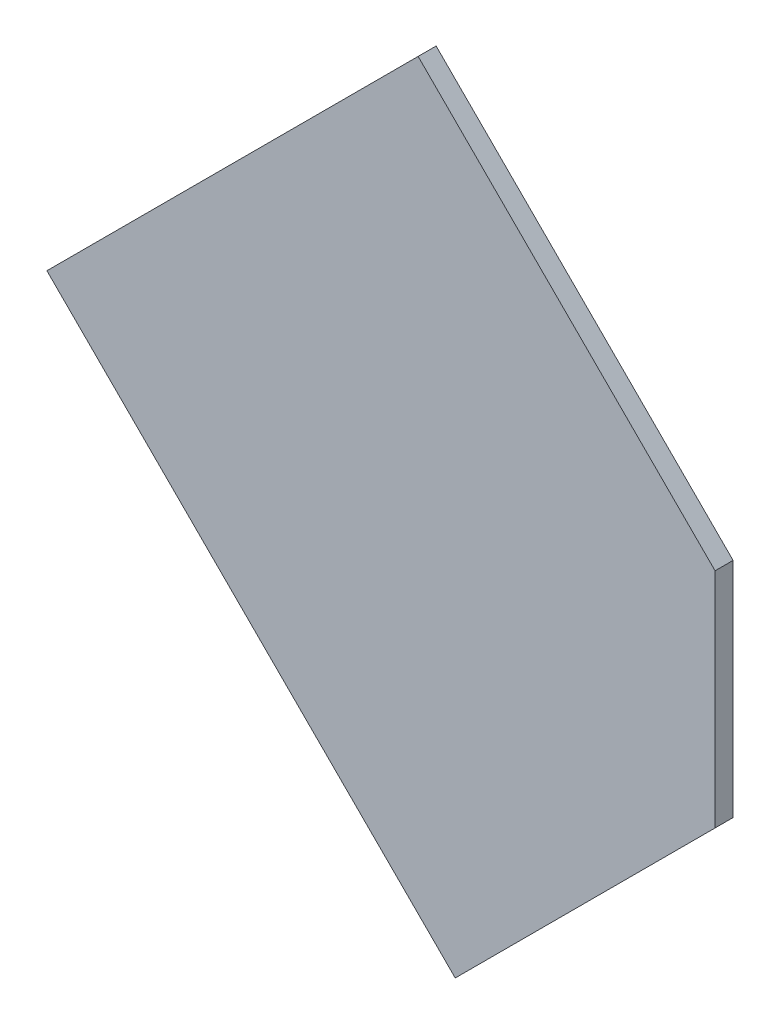
ISO-10303-21;
HEADER;
FILE_DESCRIPTION(('STEP AP214'),'2;1');
FILE_NAME('part.step','',(''),(''),'','','');
FILE_SCHEMA(('AUTOMOTIVE_DESIGN { 1 0 10303 214 1 1 1 1 }'));
ENDSEC;
DATA;
#1=APPLICATION_CONTEXT('core data for automotive mechanical design processes');
#2=APPLICATION_PROTOCOL_DEFINITION('international standard','automotive_design',2000,#1);
#3=PRODUCT_CONTEXT('',#1,'mechanical');
#4=PRODUCT('Part','Part','',(#3));
#5=PRODUCT_RELATED_PRODUCT_CATEGORY('part','',(#4));
#6=PRODUCT_DEFINITION_FORMATION('','',#4);
#7=PRODUCT_DEFINITION_CONTEXT('part definition',#1,'design');
#8=PRODUCT_DEFINITION('design','',#6,#7);
#9=PRODUCT_DEFINITION_SHAPE('','',#8);
#10=(LENGTH_UNIT() NAMED_UNIT(*) SI_UNIT(.MILLI.,.METRE.));
#11=(NAMED_UNIT(*) PLANE_ANGLE_UNIT() SI_UNIT($,.RADIAN.));
#12=(NAMED_UNIT(*) SI_UNIT($,.STERADIAN.) SOLID_ANGLE_UNIT());
#13=UNCERTAINTY_MEASURE_WITH_UNIT(LENGTH_MEASURE(1.E-05),#10,'distance_accuracy_value','');
#14=(GEOMETRIC_REPRESENTATION_CONTEXT(3) GLOBAL_UNCERTAINTY_ASSIGNED_CONTEXT((#13)) GLOBAL_UNIT_ASSIGNED_CONTEXT((#10,
#11,#12)) REPRESENTATION_CONTEXT('',''));
#15=CARTESIAN_POINT('',(0.,0.,0.));
#16=DIRECTION('',(0.,0.,1.));
#17=DIRECTION('',(1.,0.,0.));
#18=AXIS2_PLACEMENT_3D('',#15,#16,#17);
#19=CARTESIAN_POINT('',(8.694301001767,8.035939935056,0.76487));
#20=DIRECTION('',(0.,0.,-1.));
#21=DIRECTION('',(0.,1.,0.));
#22=AXIS2_PLACEMENT_3D('',#19,#20,#21);
#23=PLANE('',#22);
#24=DIRECTION('',(0.707106781186548,-0.707106781186548,0.));
#25=VECTOR('',#24,1.);
#26=CARTESIAN_POINT('',(8.697918667,8.776858,0.76487));
#27=LINE('',#26,#25);
#28=CARTESIAN_POINT('',(8.697918667,8.776858,0.76487));
#29=VERTEX_POINT('',#28);
#30=CARTESIAN_POINT('',(9.263604,8.211172667,0.76487));
#31=VERTEX_POINT('',#30);
#32=EDGE_CURVE('E62',#29,#31,#27,.T.);
#33=ORIENTED_EDGE('',*,*,#32,.T.);
#34=DIRECTION('',(0.,1.,0.));
#35=VECTOR('',#34,1.);
#36=CARTESIAN_POINT('',(9.263604,8.211172667,0.76487));
#37=LINE('',#36,#35);
#38=CARTESIAN_POINT('',(9.263604,7.786908667,0.76487));
#39=VERTEX_POINT('',#38);
#40=EDGE_CURVE('E64',#31,#39,#37,.F.);
#41=ORIENTED_EDGE('',*,*,#40,.T.);
#42=DIRECTION('',(-0.707106781186548,-0.707106781186548,0.));
#43=VECTOR('',#42,1.);
#44=CARTESIAN_POINT('',(9.263604,7.786908667,0.76487));
#45=LINE('',#44,#43);
#46=CARTESIAN_POINT('',(8.768629333,7.291934,0.76487));
#47=VERTEX_POINT('',#46);
#48=EDGE_CURVE('E20',#39,#47,#45,.T.);
#49=ORIENTED_EDGE('',*,*,#48,.T.);
#50=DIRECTION('',(-0.707106781186548,0.707106781186548,0.));
#51=VECTOR('',#50,1.);
#52=CARTESIAN_POINT('',(8.768629333,7.291934,0.76487));
#53=LINE('',#52,#51);
#54=CARTESIAN_POINT('',(7.990812,8.069751333,0.76487));
#55=VERTEX_POINT('',#54);
#56=EDGE_CURVE('E91',#47,#55,#53,.T.);
#57=ORIENTED_EDGE('',*,*,#56,.T.);
#58=DIRECTION('',(0.707106781186548,0.707106781186548,0.));
#59=VECTOR('',#58,1.);
#60=CARTESIAN_POINT('',(7.990812,8.069751333,0.76487));
#61=LINE('',#60,#59);
#62=EDGE_CURVE('E86',#55,#29,#61,.T.);
#63=ORIENTED_EDGE('',*,*,#62,.T.);
#64=EDGE_LOOP('',(#33,#41,#49,#57,#63));
#65=FACE_BOUND('',#64,.T.);
#66=ADVANCED_FACE('F17',(#65),#23,.T.);
#67=CARTESIAN_POINT('',(9.263604,7.786908667,0.76487));
#68=DIRECTION('',(-0.707106781186548,0.707106781186548,0.));
#69=DIRECTION('',(-0.707106781186548,-0.707106781186548,0.));
#70=AXIS2_PLACEMENT_3D('',#67,#68,#69);
#71=PLANE('',#70);
#72=DIRECTION('',(0.,0.,1.));
#73=VECTOR('',#72,1.);
#74=CARTESIAN_POINT('',(8.768629333,7.291934,0.76487));
#75=LINE('',#74,#73);
#76=CARTESIAN_POINT('',(8.768629333,7.291934,0.79916));
#77=VERTEX_POINT('',#76);
#78=EDGE_CURVE('E75',#77,#47,#75,.F.);
#79=ORIENTED_EDGE('',*,*,#78,.T.);
#80=ORIENTED_EDGE('',*,*,#48,.F.);
#81=DIRECTION('',(0.,0.,1.));
#82=VECTOR('',#81,1.);
#83=CARTESIAN_POINT('',(9.263604,7.786908667,0.76487));
#84=LINE('',#83,#82);
#85=CARTESIAN_POINT('',(9.263604,7.786908667,0.79916));
#86=VERTEX_POINT('',#85);
#87=EDGE_CURVE('E70',#39,#86,#84,.T.);
#88=ORIENTED_EDGE('',*,*,#87,.T.);
#89=DIRECTION('',(0.707106781186549,0.707106781186546,0.));
#90=VECTOR('',#89,1.);
#91=CARTESIAN_POINT('',(8.768629333,7.291934,0.79916));
#92=LINE('',#91,#90);
#93=EDGE_CURVE('E94',#77,#86,#92,.T.);
#94=ORIENTED_EDGE('',*,*,#93,.F.);
#95=EDGE_LOOP('',(#79,#80,#88,#94));
#96=FACE_BOUND('',#95,.T.);
#97=ADVANCED_FACE('F72',(#96),#71,.F.);
#98=CARTESIAN_POINT('',(9.263604,8.211172667,0.76487));
#99=DIRECTION('',(-1.,0.,0.));
#100=DIRECTION('',(0.,0.,1.));
#101=AXIS2_PLACEMENT_3D('',#98,#99,#100);
#102=PLANE('',#101);
#103=ORIENTED_EDGE('',*,*,#87,.F.);
#104=ORIENTED_EDGE('',*,*,#40,.F.);
#105=DIRECTION('',(0.,0.,1.));
#106=VECTOR('',#105,1.);
#107=CARTESIAN_POINT('',(9.263604,8.211172667,0.76487));
#108=LINE('',#107,#106);
#109=CARTESIAN_POINT('',(9.263604,8.211172667,0.79916));
#110=VERTEX_POINT('',#109);
#111=EDGE_CURVE('E82',#31,#110,#108,.T.);
#112=ORIENTED_EDGE('',*,*,#111,.T.);
#113=DIRECTION('',(0.,-1.,0.));
#114=VECTOR('',#113,1.);
#115=CARTESIAN_POINT('',(9.263604,8.035939935056,0.79916));
#116=LINE('',#115,#114);
#117=EDGE_CURVE('E79',#86,#110,#116,.F.);
#118=ORIENTED_EDGE('',*,*,#117,.F.);
#119=EDGE_LOOP('',(#103,#104,#112,#118));
#120=FACE_BOUND('',#119,.T.);
#121=ADVANCED_FACE('F77',(#120),#102,.F.);
#122=CARTESIAN_POINT('',(8.697918667,8.776858,0.76487));
#123=DIRECTION('',(-0.707106781186548,-0.707106781186548,0.));
#124=DIRECTION('',(0.707106781186548,-0.707106781186548,0.));
#125=AXIS2_PLACEMENT_3D('',#122,#123,#124);
#126=PLANE('',#125);
#127=ORIENTED_EDGE('',*,*,#111,.F.);
#128=ORIENTED_EDGE('',*,*,#32,.F.);
#129=DIRECTION('',(0.,0.,1.));
#130=VECTOR('',#129,1.);
#131=CARTESIAN_POINT('',(8.697918667,8.776858,0.76487));
#132=LINE('',#131,#130);
#133=CARTESIAN_POINT('',(8.697918667,8.776858,0.79916));
#134=VERTEX_POINT('',#133);
#135=EDGE_CURVE('E88',#29,#134,#132,.T.);
#136=ORIENTED_EDGE('',*,*,#135,.T.);
#137=DIRECTION('',(-0.707106781186549,0.707106781186546,0.));
#138=VECTOR('',#137,1.);
#139=CARTESIAN_POINT('',(9.263604,8.211172667,0.79916));
#140=LINE('',#139,#138);
#141=EDGE_CURVE('E97',#110,#134,#140,.T.);
#142=ORIENTED_EDGE('',*,*,#141,.F.);
#143=EDGE_LOOP('',(#127,#128,#136,#142));
#144=FACE_BOUND('',#143,.T.);
#145=ADVANCED_FACE('F107',(#144),#126,.F.);
#146=CARTESIAN_POINT('',(7.990812,8.069751333,0.76487));
#147=DIRECTION('',(0.707106781186548,-0.707106781186548,0.));
#148=DIRECTION('',(0.707106781186548,0.707106781186548,0.));
#149=AXIS2_PLACEMENT_3D('',#146,#147,#148);
#150=PLANE('',#149);
#151=ORIENTED_EDGE('',*,*,#135,.F.);
#152=ORIENTED_EDGE('',*,*,#62,.F.);
#153=DIRECTION('',(0.,0.,1.));
#154=VECTOR('',#153,1.);
#155=CARTESIAN_POINT('',(7.990812,8.069751333,0.76487));
#156=LINE('',#155,#154);
#157=CARTESIAN_POINT('',(7.990812,8.069751333,0.79916));
#158=VERTEX_POINT('',#157);
#159=EDGE_CURVE('E35',#55,#158,#156,.T.);
#160=ORIENTED_EDGE('',*,*,#159,.T.);
#161=DIRECTION('',(-0.707106781186547,-0.707106781186548,0.));
#162=VECTOR('',#161,1.);
#163=CARTESIAN_POINT('',(8.697918667,8.776858,0.79916));
#164=LINE('',#163,#162);
#165=EDGE_CURVE('E26',#134,#158,#164,.T.);
#166=ORIENTED_EDGE('',*,*,#165,.F.);
#167=EDGE_LOOP('',(#151,#152,#160,#166));
#168=FACE_BOUND('',#167,.T.);
#169=ADVANCED_FACE('F105',(#168),#150,.F.);
#170=CARTESIAN_POINT('',(8.768629333,7.291934,0.76487));
#171=DIRECTION('',(0.707106781186548,0.707106781186548,0.));
#172=DIRECTION('',(-0.707106781186548,0.707106781186548,0.));
#173=AXIS2_PLACEMENT_3D('',#170,#171,#172);
#174=PLANE('',#173);
#175=ORIENTED_EDGE('',*,*,#159,.F.);
#176=ORIENTED_EDGE('',*,*,#56,.F.);
#177=ORIENTED_EDGE('',*,*,#78,.F.);
#178=DIRECTION('',(0.707106781186549,-0.707106781186546,0.));
#179=VECTOR('',#178,1.);
#180=CARTESIAN_POINT('',(7.990812,8.069751333,0.79916));
#181=LINE('',#180,#179);
#182=EDGE_CURVE('E11',#158,#77,#181,.T.);
#183=ORIENTED_EDGE('',*,*,#182,.F.);
#184=EDGE_LOOP('',(#175,#176,#177,#183));
#185=FACE_BOUND('',#184,.T.);
#186=ADVANCED_FACE('F109',(#185),#174,.F.);
#187=CARTESIAN_POINT('',(8.694301001767,8.035939935056,0.79916));
#188=DIRECTION('',(0.,0.,1.));
#189=DIRECTION('',(0.,-1.,0.));
#190=AXIS2_PLACEMENT_3D('',#187,#188,#189);
#191=PLANE('',#190);
#192=ORIENTED_EDGE('',*,*,#165,.T.);
#193=ORIENTED_EDGE('',*,*,#182,.T.);
#194=ORIENTED_EDGE('',*,*,#93,.T.);
#195=ORIENTED_EDGE('',*,*,#117,.T.);
#196=ORIENTED_EDGE('',*,*,#141,.T.);
#197=EDGE_LOOP('',(#192,#193,#194,#195,#196));
#198=FACE_BOUND('',#197,.T.);
#199=ADVANCED_FACE('F102',(#198),#191,.T.);
#200=CLOSED_SHELL('',(#66,#97,#121,#145,#169,#186,#199));
#201=MANIFOLD_SOLID_BREP('B1',#200);
#202=ADVANCED_BREP_SHAPE_REPRESENTATION('',(#18,#201),#14);
#203=SHAPE_DEFINITION_REPRESENTATION(#9,#202);
ENDSEC;
END-ISO-10303-21;
